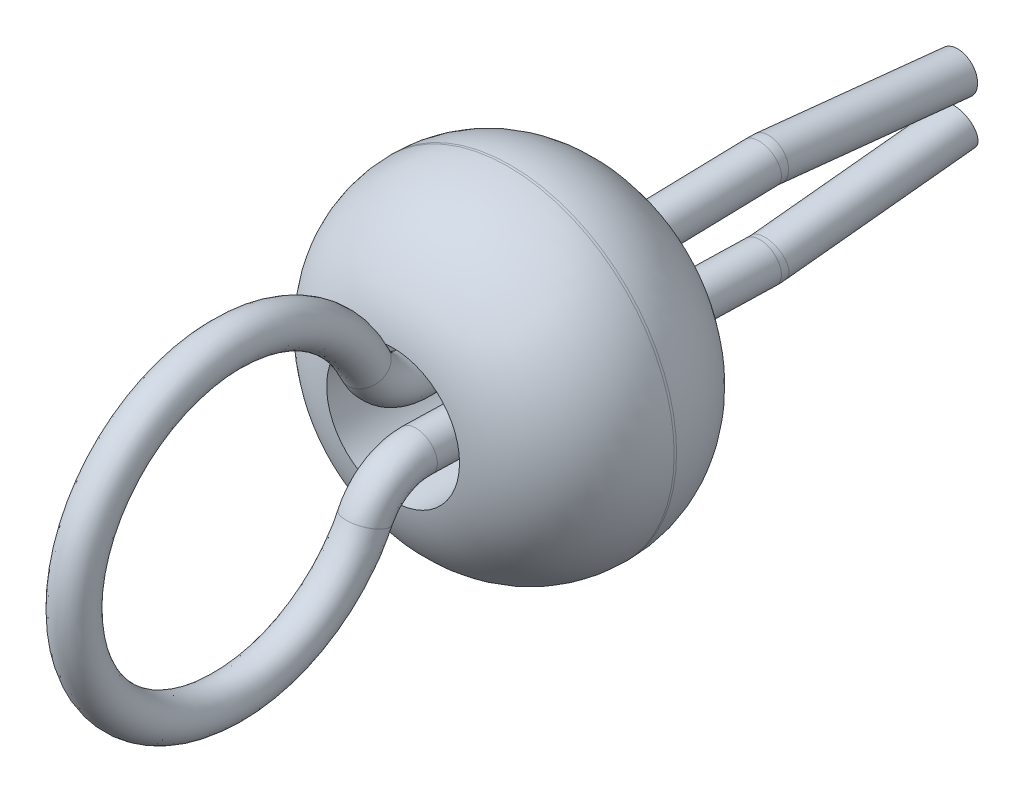
ISO-10303-21;
HEADER;
FILE_DESCRIPTION(('STEP AP214'),'2;1');
FILE_NAME('part.step','',(''),(''),'','','');
FILE_SCHEMA(('AUTOMOTIVE_DESIGN { 1 0 10303 214 1 1 1 1 }'));
ENDSEC;
DATA;
#1=APPLICATION_CONTEXT('core data for automotive mechanical design processes');
#2=APPLICATION_PROTOCOL_DEFINITION('international standard','automotive_design',2000,#1);
#3=PRODUCT_CONTEXT('',#1,'mechanical');
#4=PRODUCT('Part','Part','',(#3));
#5=PRODUCT_RELATED_PRODUCT_CATEGORY('part','',(#4));
#6=PRODUCT_DEFINITION_FORMATION('','',#4);
#7=PRODUCT_DEFINITION_CONTEXT('part definition',#1,'design');
#8=PRODUCT_DEFINITION('design','',#6,#7);
#9=PRODUCT_DEFINITION_SHAPE('','',#8);
#10=(LENGTH_UNIT() NAMED_UNIT(*) SI_UNIT(.MILLI.,.METRE.));
#11=(NAMED_UNIT(*) PLANE_ANGLE_UNIT() SI_UNIT($,.RADIAN.));
#12=(NAMED_UNIT(*) SI_UNIT($,.STERADIAN.) SOLID_ANGLE_UNIT());
#13=UNCERTAINTY_MEASURE_WITH_UNIT(LENGTH_MEASURE(1.E-05),#10,'distance_accuracy_value','');
#14=(GEOMETRIC_REPRESENTATION_CONTEXT(3) GLOBAL_UNCERTAINTY_ASSIGNED_CONTEXT((#13)) GLOBAL_UNIT_ASSIGNED_CONTEXT((#10,
#11,#12)) REPRESENTATION_CONTEXT('',''));
#15=CARTESIAN_POINT('',(0.,0.,0.));
#16=DIRECTION('',(0.,0.,1.));
#17=DIRECTION('',(1.,0.,0.));
#18=AXIS2_PLACEMENT_3D('',#15,#16,#17);
#19=CARTESIAN_POINT('',(0.,-0.327336477502774,-1.09448071747318));
#20=DIRECTION('',(0.,0.204705882352955,-0.978823529411762));
#21=DIRECTION('',(1.,0.,0.));
#22=AXIS2_PLACEMENT_3D('',#19,#20,#21);
#23=CIRCLE('',#22,0.1524);
#24=DIRECTION('',(0.,0.102899151085505,-0.994691793826551));
#25=VECTOR('',#24,1.);
#26=SURFACE_OF_LINEAR_EXTRUSION('',#23,#25);
#27=CARTESIAN_POINT('',(0.1524,-0.327336477502774,-1.09448071747318));
#28=VERTEX_POINT('',#27);
#29=EDGE_CURVE('E53',#28,#28,#23,.T.);
#30=ORIENTED_EDGE('',*,*,#29,.T.);
#31=EDGE_LOOP('',(#30));
#32=FACE_BOUND('',#31,.T.);
#33=CARTESIAN_POINT('',(0.,-0.177799999999998,-2.54000000000002));
#34=DIRECTION('',(0.,0.204705882352955,-0.978823529411762));
#35=DIRECTION('',(1.,0.,0.));
#36=AXIS2_PLACEMENT_3D('',#33,#34,#35);
#37=CIRCLE('',#36,0.1524);
#38=CARTESIAN_POINT('',(0.1524,-0.177799999999998,-2.54000000000002));
#39=VERTEX_POINT('',#38);
#40=EDGE_CURVE('E11',#39,#39,#37,.T.);
#41=ORIENTED_EDGE('',*,*,#40,.F.);
#42=EDGE_LOOP('',(#41));
#43=FACE_BOUND('',#42,.T.);
#44=ADVANCED_FACE('F46',(#32,#43),#26,.T.);
#45=CARTESIAN_POINT('',(0.,-0.329486684795185,-1.03898070701224));
#46=DIRECTION('',(0.,0.0773688039422496,-0.997002541710173));
#47=DIRECTION('',(1.,0.,0.));
#48=AXIS2_PLACEMENT_3D('',#45,#46,#47);
#49=CIRCLE('',#48,0.1524);
#50=CARTESIAN_POINT('',(0.,0.102171439071529,-1.05004886403444));
#51=DIRECTION('',(1.,0.,0.));
#52=AXIS1_PLACEMENT('',#50,#51);
#53=SURFACE_OF_REVOLUTION('',#49,#52);
#54=CARTESIAN_POINT('',(0.1524,-0.329486684795185,-1.03898070701224));
#55=VERTEX_POINT('',#54);
#56=EDGE_CURVE('E60',#55,#55,#49,.T.);
#57=ORIENTED_EDGE('',*,*,#56,.T.);
#58=EDGE_LOOP('',(#57));
#59=FACE_BOUND('',#58,.T.);
#60=ORIENTED_EDGE('',*,*,#29,.F.);
#61=EDGE_LOOP('',(#60));
#62=FACE_BOUND('',#61,.T.);
#63=ADVANCED_FACE('F74',(#59,#62),#53,.F.);
#64=CARTESIAN_POINT('',(0.,-0.262021826935956,1.5921487494977));
#65=DIRECTION('',(0.,0.0773688039422496,-0.997002541710173));
#66=DIRECTION('',(1.,0.,0.));
#67=AXIS2_PLACEMENT_3D('',#64,#65,#66);
#68=CIRCLE('',#67,0.1524);
#69=DIRECTION('',(0.,-0.0256326007925508,-0.999671430909481));
#70=VECTOR('',#69,1.);
#71=SURFACE_OF_LINEAR_EXTRUSION('',#68,#70);
#72=CARTESIAN_POINT('',(0.1524,-0.262021826935956,1.5921487494977));
#73=VERTEX_POINT('',#72);
#74=EDGE_CURVE('E67',#73,#73,#68,.T.);
#75=ORIENTED_EDGE('',*,*,#74,.T.);
#76=EDGE_LOOP('',(#75));
#77=FACE_BOUND('',#76,.T.);
#78=ORIENTED_EDGE('',*,*,#56,.F.);
#79=EDGE_LOOP('',(#78));
#80=FACE_BOUND('',#79,.T.);
#81=ADVANCED_FACE('F77',(#77,#80),#71,.T.);
#82=CARTESIAN_POINT('',(0.,-0.506786371505022,1.99247521409643));
#83=DIRECTION('',(0.,0.941230279940282,-0.337765540165863));
#84=DIRECTION('',(1.,0.,0.));
#85=AXIS2_PLACEMENT_3D('',#82,#83,#84);
#86=CIRCLE('',#85,0.1524);
#87=CARTESIAN_POINT('',(0.,-0.69367995080267,1.60321690651994));
#88=DIRECTION('',(-1.,0.,0.));
#89=AXIS1_PLACEMENT('',#87,#88);
#90=SURFACE_OF_REVOLUTION('',#86,#89);
#91=CARTESIAN_POINT('',(0.1524,-0.506786371505022,1.99247521409643));
#92=VERTEX_POINT('',#91);
#93=EDGE_CURVE('E89',#92,#92,#86,.T.);
#94=ORIENTED_EDGE('',*,*,#93,.T.);
#95=EDGE_LOOP('',(#94));
#96=FACE_BOUND('',#95,.T.);
#97=ORIENTED_EDGE('',*,*,#74,.F.);
#98=EDGE_LOOP('',(#97));
#99=FACE_BOUND('',#98,.T.);
#100=ADVANCED_FACE('F81',(#96,#99),#90,.F.);
#101=CARTESIAN_POINT('',(0.,0.506786371505037,1.99247521409644));
#102=DIRECTION('',(0.,0.852155751672292,0.523288233091315));
#103=DIRECTION('',(1.,0.,0.));
#104=AXIS2_PLACEMENT_3D('',#101,#102,#103);
#105=CIRCLE('',#104,0.1524);
#106=CARTESIAN_POINT('',(0.,0.,3.048));
#107=DIRECTION('',(1.,0.,0.));
#108=AXIS1_PLACEMENT('',#106,#107);
#109=SURFACE_OF_REVOLUTION('',#105,#108);
#110=CARTESIAN_POINT('',(0.1524,0.506786371505037,1.99247521409644));
#111=VERTEX_POINT('',#110);
#112=EDGE_CURVE('E92',#111,#111,#105,.T.);
#113=ORIENTED_EDGE('',*,*,#112,.T.);
#114=EDGE_LOOP('',(#113));
#115=FACE_BOUND('',#114,.T.);
#116=ORIENTED_EDGE('',*,*,#93,.F.);
#117=EDGE_LOOP('',(#116));
#118=FACE_BOUND('',#117,.T.);
#119=ADVANCED_FACE('F85',(#115,#118),#109,.F.);
#120=CARTESIAN_POINT('',(0.,0.262021826935956,1.59214874949772));
#121=DIRECTION('',(0.,-0.1283618792678,0.99172739598684));
#122=DIRECTION('',(1.,0.,0.));
#123=AXIS2_PLACEMENT_3D('',#120,#121,#122);
#124=CIRCLE('',#123,0.1524);
#125=CARTESIAN_POINT('',(0.,0.69367995080267,1.60321690651994));
#126=DIRECTION('',(-1.,0.,0.));
#127=AXIS1_PLACEMENT('',#125,#126);
#128=SURFACE_OF_REVOLUTION('',#124,#127);
#129=CARTESIAN_POINT('',(0.1524,0.262021826935956,1.59214874949772));
#130=VERTEX_POINT('',#129);
#131=EDGE_CURVE('E96',#130,#130,#124,.T.);
#132=ORIENTED_EDGE('',*,*,#131,.T.);
#133=EDGE_LOOP('',(#132));
#134=FACE_BOUND('',#133,.T.);
#135=ORIENTED_EDGE('',*,*,#112,.F.);
#136=EDGE_LOOP('',(#135));
#137=FACE_BOUND('',#136,.T.);
#138=ADVANCED_FACE('F103',(#134,#137),#128,.F.);
#139=CARTESIAN_POINT('',(0.,0.329486684795185,-1.03898070701222));
#140=DIRECTION('',(0.,-0.1283618792678,0.99172739598684));
#141=DIRECTION('',(1.,0.,0.));
#142=AXIS2_PLACEMENT_3D('',#139,#140,#141);
#143=CIRCLE('',#142,0.1524);
#144=DIRECTION('',(0.,-0.0256326007925508,0.999671430909481));
#145=VECTOR('',#144,1.);
#146=SURFACE_OF_LINEAR_EXTRUSION('',#143,#145);
#147=CARTESIAN_POINT('',(0.1524,0.329486684795185,-1.03898070701222));
#148=VERTEX_POINT('',#147);
#149=EDGE_CURVE('E100',#148,#148,#143,.T.);
#150=ORIENTED_EDGE('',*,*,#149,.T.);
#151=EDGE_LOOP('',(#150));
#152=FACE_BOUND('',#151,.T.);
#153=ORIENTED_EDGE('',*,*,#131,.F.);
#154=EDGE_LOOP('',(#153));
#155=FACE_BOUND('',#154,.T.);
#156=ADVANCED_FACE('F106',(#152,#155),#146,.T.);
#157=CARTESIAN_POINT('',(0.,0.327336477502776,-1.09448071747316));
#158=DIRECTION('',(0.,0.,1.));
#159=DIRECTION('',(1.,0.,0.));
#160=AXIS2_PLACEMENT_3D('',#157,#158,#159);
#161=CIRCLE('',#160,0.1524);
#162=CARTESIAN_POINT('',(0.,-0.102171439071529,-1.05004886403444));
#163=DIRECTION('',(1.,0.,0.));
#164=AXIS1_PLACEMENT('',#162,#163);
#165=SURFACE_OF_REVOLUTION('',#161,#164);
#166=CARTESIAN_POINT('',(0.1524,0.327336477502776,-1.09448071747316));
#167=VERTEX_POINT('',#166);
#168=EDGE_CURVE('E118',#167,#167,#161,.T.);
#169=ORIENTED_EDGE('',*,*,#168,.T.);
#170=EDGE_LOOP('',(#169));
#171=FACE_BOUND('',#170,.T.);
#172=ORIENTED_EDGE('',*,*,#149,.F.);
#173=EDGE_LOOP('',(#172));
#174=FACE_BOUND('',#173,.T.);
#175=ADVANCED_FACE('F110',(#171,#174),#165,.F.);
#176=DIRECTION('',(0.,-0.102899151085505,-0.994691793826551));
#177=VECTOR('',#176,1.);
#178=SURFACE_OF_LINEAR_EXTRUSION('',#161,#177);
#179=ORIENTED_EDGE('',*,*,#168,.F.);
#180=EDGE_LOOP('',(#179));
#181=FACE_BOUND('',#180,.T.);
#182=CARTESIAN_POINT('',(0.,0.1778,-2.54));
#183=DIRECTION('',(0.,0.,1.));
#184=DIRECTION('',(1.,0.,0.));
#185=AXIS2_PLACEMENT_3D('',#182,#183,#184);
#186=CIRCLE('',#185,0.1524);
#187=CARTESIAN_POINT('',(0.1524,0.1778,-2.54));
#188=VERTEX_POINT('',#187);
#189=EDGE_CURVE('E121',#188,#188,#186,.T.);
#190=ORIENTED_EDGE('',*,*,#189,.T.);
#191=EDGE_LOOP('',(#190));
#192=FACE_BOUND('',#191,.T.);
#193=ADVANCED_FACE('F115',(#181,#192),#178,.F.);
#194=CARTESIAN_POINT('',(0.,-0.177799999999998,-2.54000000000002));
#195=DIRECTION('',(0.,0.204705882352955,-0.978823529411762));
#196=DIRECTION('',(1.,0.,0.));
#197=AXIS2_PLACEMENT_3D('',#194,#195,#196);
#198=PLANE('',#197);
#199=ORIENTED_EDGE('',*,*,#40,.T.);
#200=EDGE_LOOP('',(#199));
#201=FACE_BOUND('',#200,.T.);
#202=ADVANCED_FACE('F131',(#201),#198,.T.);
#203=CARTESIAN_POINT('',(0.,0.1778,-2.54));
#204=DIRECTION('',(0.,0.,1.));
#205=DIRECTION('',(1.,0.,0.));
#206=AXIS2_PLACEMENT_3D('',#203,#204,#205);
#207=PLANE('',#206);
#208=ORIENTED_EDGE('',*,*,#189,.F.);
#209=EDGE_LOOP('',(#208));
#210=FACE_BOUND('',#209,.T.);
#211=ADVANCED_FACE('F129',(#210),#207,.F.);
#212=CLOSED_SHELL('',(#44,#63,#81,#100,#119,#138,#156,#175,#193,#202,#211));
#213=MANIFOLD_SOLID_BREP('B2',#212);
#214=CARTESIAN_POINT('',(0.,0.,1.778));
#215=DIRECTION('',(0.,0.,-1.));
#216=DIRECTION('',(-1.,0.,0.));
#217=AXIS2_PLACEMENT_3D('',#214,#215,#216);
#218=CYLINDRICAL_SURFACE('',#217,1.27);
#219=CARTESIAN_POINT('',(0.,0.,0.87988181024499));
#220=DIRECTION('',(0.,0.,-1.));
#221=DIRECTION('',(-1.,0.,0.));
#222=AXIS2_PLACEMENT_3D('',#219,#220,#221);
#223=CIRCLE('',#222,1.27);
#224=CARTESIAN_POINT('',(-1.27,0.,0.87988181024499));
#225=VERTEX_POINT('',#224);
#226=EDGE_CURVE('E45',#225,#225,#223,.F.);
#227=ORIENTED_EDGE('',*,*,#226,.T.);
#228=EDGE_LOOP('',(#227));
#229=FACE_BOUND('',#228,.T.);
#230=CARTESIAN_POINT('',(0.,0.,0.89811818975501));
#231=DIRECTION('',(0.,0.,1.));
#232=DIRECTION('',(1.,0.,0.));
#233=AXIS2_PLACEMENT_3D('',#230,#231,#232);
#234=CIRCLE('',#233,1.27);
#235=CARTESIAN_POINT('',(1.27,0.,0.89811818975501));
#236=VERTEX_POINT('',#235);
#237=EDGE_CURVE('E244',#236,#236,#234,.F.);
#238=ORIENTED_EDGE('',*,*,#237,.T.);
#239=EDGE_LOOP('',(#238));
#240=FACE_BOUND('',#239,.T.);
#241=ADVANCED_FACE('F236',(#229,#240),#218,.T.);
#242=CARTESIAN_POINT('',(0.,0.,1.778));
#243=DIRECTION('',(0.,0.,-1.));
#244=DIRECTION('',(-1.,0.,0.));
#245=AXIS2_PLACEMENT_3D('',#242,#243,#244);
#246=CYLINDRICAL_SURFACE('',#245,0.508);
#247=CARTESIAN_POINT('',(0.,0.,1.778));
#248=DIRECTION('',(0.,0.,1.));
#249=DIRECTION('',(1.,0.,0.));
#250=AXIS2_PLACEMENT_3D('',#247,#248,#249);
#251=CIRCLE('',#250,0.508);
#252=CARTESIAN_POINT('',(0.508,0.,1.778));
#253=VERTEX_POINT('',#252);
#254=EDGE_CURVE('E250',#253,#253,#251,.T.);
#255=ORIENTED_EDGE('',*,*,#254,.T.);
#256=EDGE_LOOP('',(#255));
#257=FACE_BOUND('',#256,.T.);
#258=CARTESIAN_POINT('',(0.,0.,0.));
#259=DIRECTION('',(0.,0.,1.));
#260=DIRECTION('',(1.,0.,0.));
#261=AXIS2_PLACEMENT_3D('',#258,#259,#260);
#262=CIRCLE('',#261,0.508);
#263=CARTESIAN_POINT('',(0.508,0.,0.));
#264=VERTEX_POINT('',#263);
#265=EDGE_CURVE('E255',#264,#264,#262,.T.);
#266=ORIENTED_EDGE('',*,*,#265,.F.);
#267=EDGE_LOOP('',(#266));
#268=FACE_BOUND('',#267,.T.);
#269=ADVANCED_FACE('F264',(#257,#268),#246,.F.);
#270=CARTESIAN_POINT('',(0.,0.,0.87988181024499));
#271=DIRECTION('',(0.,0.,-1.));
#272=DIRECTION('',(-1.,0.,0.));
#273=AXIS2_PLACEMENT_3D('',#270,#271,#272);
#274=DEGENERATE_TOROIDAL_SURFACE('',#273,0.381000000000001,0.889,.T.);
#275=ORIENTED_EDGE('',*,*,#265,.T.);
#276=EDGE_LOOP('',(#275));
#277=FACE_BOUND('',#276,.T.);
#278=ORIENTED_EDGE('',*,*,#226,.F.);
#279=EDGE_LOOP('',(#278));
#280=FACE_BOUND('',#279,.T.);
#281=ADVANCED_FACE('F261',(#277,#280),#274,.T.);
#282=CARTESIAN_POINT('',(0.,0.,0.89811818975501));
#283=DIRECTION('',(0.,0.,1.));
#284=DIRECTION('',(1.,0.,0.));
#285=AXIS2_PLACEMENT_3D('',#282,#283,#284);
#286=DEGENERATE_TOROIDAL_SURFACE('',#285,0.381000000000001,0.889,.T.);
#287=ORIENTED_EDGE('',*,*,#237,.F.);
#288=EDGE_LOOP('',(#287));
#289=FACE_BOUND('',#288,.T.);
#290=ORIENTED_EDGE('',*,*,#254,.F.);
#291=EDGE_LOOP('',(#290));
#292=FACE_BOUND('',#291,.T.);
#293=ADVANCED_FACE('F238',(#289,#292),#286,.T.);
#294=CLOSED_SHELL('',(#241,#269,#281,#293));
#295=MANIFOLD_SOLID_BREP('B6',#294);
#296=ADVANCED_BREP_SHAPE_REPRESENTATION('',(#18,#213,#295),#14);
#297=SHAPE_DEFINITION_REPRESENTATION(#9,#296);
ENDSEC;
END-ISO-10303-21;
